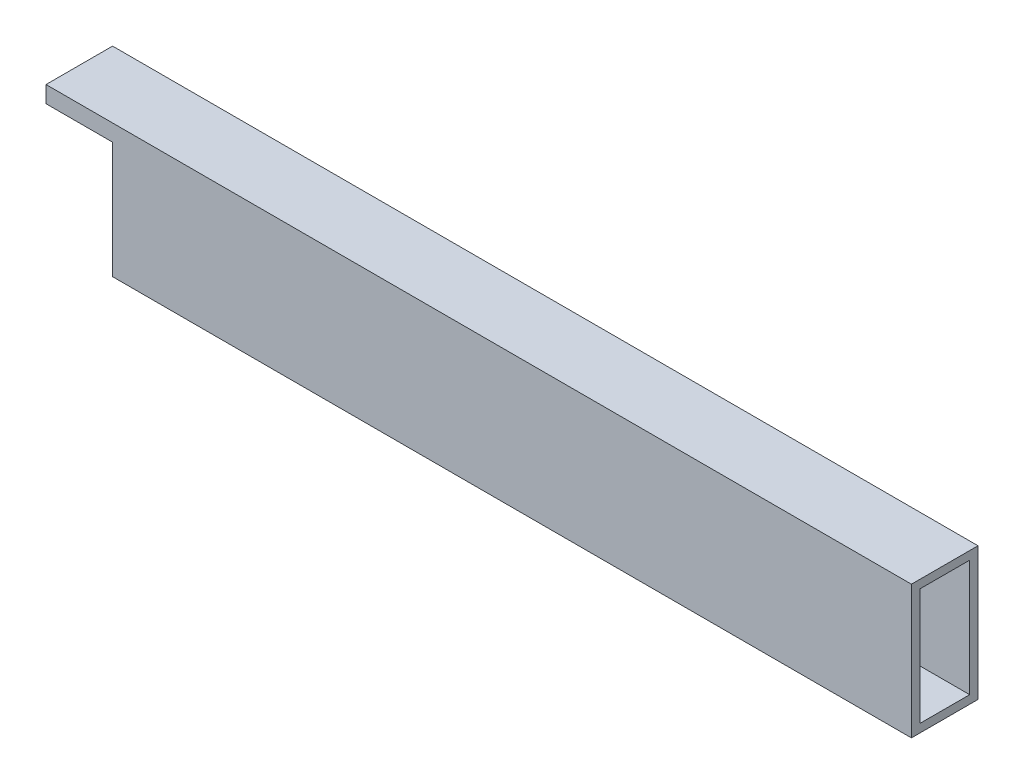
ISO-10303-21;
HEADER;
FILE_DESCRIPTION(('STEP AP214'),'2;1');
FILE_NAME('part.step','',(''),(''),'','','');
FILE_SCHEMA(('AUTOMOTIVE_DESIGN { 1 0 10303 214 1 1 1 1 }'));
ENDSEC;
DATA;
#1=APPLICATION_CONTEXT('core data for automotive mechanical design processes');
#2=APPLICATION_PROTOCOL_DEFINITION('international standard','automotive_design',2000,#1);
#3=PRODUCT_CONTEXT('',#1,'mechanical');
#4=PRODUCT('Part','Part','',(#3));
#5=PRODUCT_RELATED_PRODUCT_CATEGORY('part','',(#4));
#6=PRODUCT_DEFINITION_FORMATION('','',#4);
#7=PRODUCT_DEFINITION_CONTEXT('part definition',#1,'design');
#8=PRODUCT_DEFINITION('design','',#6,#7);
#9=PRODUCT_DEFINITION_SHAPE('','',#8);
#10=(LENGTH_UNIT() NAMED_UNIT(*) SI_UNIT(.MILLI.,.METRE.));
#11=(NAMED_UNIT(*) PLANE_ANGLE_UNIT() SI_UNIT($,.RADIAN.));
#12=(NAMED_UNIT(*) SI_UNIT($,.STERADIAN.) SOLID_ANGLE_UNIT());
#13=UNCERTAINTY_MEASURE_WITH_UNIT(LENGTH_MEASURE(1.E-05),#10,'distance_accuracy_value','');
#14=(GEOMETRIC_REPRESENTATION_CONTEXT(3) GLOBAL_UNCERTAINTY_ASSIGNED_CONTEXT((#13)) GLOBAL_UNIT_ASSIGNED_CONTEXT((#10,
#11,#12)) REPRESENTATION_CONTEXT('',''));
#15=CARTESIAN_POINT('',(0.,0.,0.));
#16=DIRECTION('',(0.,0.,1.));
#17=DIRECTION('',(1.,0.,0.));
#18=AXIS2_PLACEMENT_3D('',#15,#16,#17);
#19=CARTESIAN_POINT('',(-330.2,50.8,25.4));
#20=DIRECTION('',(1.,0.,0.));
#21=DIRECTION('',(0.,0.,-1.));
#22=AXIS2_PLACEMENT_3D('',#19,#20,#21);
#23=PLANE('',#22);
#24=DIRECTION('',(0.,-1.,0.));
#25=VECTOR('',#24,1.);
#26=CARTESIAN_POINT('',(-330.2,50.8,0.));
#27=LINE('',#26,#25);
#28=CARTESIAN_POINT('',(-330.2,50.8,0.));
#29=VERTEX_POINT('',#28);
#30=CARTESIAN_POINT('',(-330.2,44.45,0.));
#31=VERTEX_POINT('',#30);
#32=EDGE_CURVE('E201',#29,#31,#27,.T.);
#33=ORIENTED_EDGE('',*,*,#32,.T.);
#34=DIRECTION('',(0.,0.,-1.));
#35=VECTOR('',#34,1.);
#36=CARTESIAN_POINT('',(-330.2,44.45,31.496));
#37=LINE('',#36,#35);
#38=CARTESIAN_POINT('',(-330.2,44.45,3.175));
#39=VERTEX_POINT('',#38);
#40=EDGE_CURVE('E137',#39,#31,#37,.T.);
#41=ORIENTED_EDGE('',*,*,#40,.F.);
#42=DIRECTION('',(0.,-1.,0.));
#43=VECTOR('',#42,1.);
#44=CARTESIAN_POINT('',(-330.2,47.625,3.175));
#45=LINE('',#44,#43);
#46=CARTESIAN_POINT('',(-330.2,47.625,3.175));
#47=VERTEX_POINT('',#46);
#48=EDGE_CURVE('E163',#47,#39,#45,.T.);
#49=ORIENTED_EDGE('',*,*,#48,.F.);
#50=DIRECTION('',(0.,0.,-1.));
#51=VECTOR('',#50,1.);
#52=CARTESIAN_POINT('',(-330.2,47.625,3.175));
#53=LINE('',#52,#51);
#54=CARTESIAN_POINT('',(-330.2,47.625,22.225));
#55=VERTEX_POINT('',#54);
#56=EDGE_CURVE('E168',#55,#47,#53,.T.);
#57=ORIENTED_EDGE('',*,*,#56,.F.);
#58=DIRECTION('',(0.,1.,0.));
#59=VECTOR('',#58,1.);
#60=CARTESIAN_POINT('',(-330.2,47.625,22.225));
#61=LINE('',#60,#59);
#62=CARTESIAN_POINT('',(-330.2,44.45,22.225));
#63=VERTEX_POINT('',#62);
#64=EDGE_CURVE('E178',#63,#55,#61,.T.);
#65=ORIENTED_EDGE('',*,*,#64,.F.);
#66=CARTESIAN_POINT('',(-330.2,44.45,25.4));
#67=VERTEX_POINT('',#66);
#68=EDGE_CURVE('E150',#67,#63,#37,.T.);
#69=ORIENTED_EDGE('',*,*,#68,.F.);
#70=DIRECTION('',(0.,-1.,0.));
#71=VECTOR('',#70,1.);
#72=CARTESIAN_POINT('',(-330.2,50.8,25.4));
#73=LINE('',#72,#71);
#74=CARTESIAN_POINT('',(-330.2,50.8,25.4));
#75=VERTEX_POINT('',#74);
#76=EDGE_CURVE('E212',#75,#67,#73,.T.);
#77=ORIENTED_EDGE('',*,*,#76,.F.);
#78=DIRECTION('',(0.,0.,1.));
#79=VECTOR('',#78,1.);
#80=CARTESIAN_POINT('',(-330.2,50.8,25.4));
#81=LINE('',#80,#79);
#82=EDGE_CURVE('E192',#29,#75,#81,.T.);
#83=ORIENTED_EDGE('',*,*,#82,.F.);
#84=EDGE_LOOP('',(#33,#41,#49,#57,#65,#69,#77,#83));
#85=FACE_BOUND('',#84,.T.);
#86=ADVANCED_FACE('F33',(#85),#23,.F.);
#87=CARTESIAN_POINT('',(0.,50.8,25.4));
#88=DIRECTION('',(0.,0.,-1.));
#89=DIRECTION('',(-1.,0.,0.));
#90=AXIS2_PLACEMENT_3D('',#87,#88,#89);
#91=PLANE('',#90);
#92=ORIENTED_EDGE('',*,*,#76,.T.);
#93=DIRECTION('',(1.,0.,0.));
#94=VECTOR('',#93,1.);
#95=CARTESIAN_POINT('',(0.,44.45,25.4));
#96=LINE('',#95,#94);
#97=CARTESIAN_POINT('',(-304.8,44.45,25.4));
#98=VERTEX_POINT('',#97);
#99=EDGE_CURVE('E160',#67,#98,#96,.T.);
#100=ORIENTED_EDGE('',*,*,#99,.T.);
#101=DIRECTION('',(0.,-1.,0.));
#102=VECTOR('',#101,1.);
#103=CARTESIAN_POINT('',(-304.8,50.8,25.4));
#104=LINE('',#103,#102);
#105=CARTESIAN_POINT('',(-304.8,0.,25.4));
#106=VERTEX_POINT('',#105);
#107=EDGE_CURVE('E155',#98,#106,#104,.T.);
#108=ORIENTED_EDGE('',*,*,#107,.T.);
#109=DIRECTION('',(1.,0.,0.));
#110=VECTOR('',#109,1.);
#111=CARTESIAN_POINT('',(0.,0.,25.4));
#112=LINE('',#111,#110);
#113=CARTESIAN_POINT('',(0.,0.,25.4));
#114=VERTEX_POINT('',#113);
#115=EDGE_CURVE('E184',#106,#114,#112,.T.);
#116=ORIENTED_EDGE('',*,*,#115,.T.);
#117=DIRECTION('',(0.,-1.,0.));
#118=VECTOR('',#117,1.);
#119=CARTESIAN_POINT('',(0.,50.8,25.4));
#120=LINE('',#119,#118);
#121=CARTESIAN_POINT('',(0.,50.8,25.4));
#122=VERTEX_POINT('',#121);
#123=EDGE_CURVE('E209',#122,#114,#120,.T.);
#124=ORIENTED_EDGE('',*,*,#123,.F.);
#125=DIRECTION('',(1.,0.,0.));
#126=VECTOR('',#125,1.);
#127=CARTESIAN_POINT('',(0.,50.8,25.4));
#128=LINE('',#127,#126);
#129=EDGE_CURVE('E195',#75,#122,#128,.T.);
#130=ORIENTED_EDGE('',*,*,#129,.F.);
#131=EDGE_LOOP('',(#92,#100,#108,#116,#124,#130));
#132=FACE_BOUND('',#131,.T.);
#133=ADVANCED_FACE('F247',(#132),#91,.F.);
#134=CARTESIAN_POINT('',(0.,50.8,0.));
#135=DIRECTION('',(-1.,0.,0.));
#136=DIRECTION('',(0.,0.,1.));
#137=AXIS2_PLACEMENT_3D('',#134,#135,#136);
#138=PLANE('',#137);
#139=DIRECTION('',(0.,0.,-1.));
#140=VECTOR('',#139,1.);
#141=CARTESIAN_POINT('',(0.,47.625,3.175));
#142=LINE('',#141,#140);
#143=CARTESIAN_POINT('',(0.,47.625,22.225));
#144=VERTEX_POINT('',#143);
#145=CARTESIAN_POINT('',(0.,47.625,3.175));
#146=VERTEX_POINT('',#145);
#147=EDGE_CURVE('E172',#144,#146,#142,.T.);
#148=ORIENTED_EDGE('',*,*,#147,.T.);
#149=DIRECTION('',(0.,-1.,0.));
#150=VECTOR('',#149,1.);
#151=CARTESIAN_POINT('',(0.,47.625,3.175));
#152=LINE('',#151,#150);
#153=CARTESIAN_POINT('',(0.,3.175,3.17500000000001));
#154=VERTEX_POINT('',#153);
#155=EDGE_CURVE('E164',#146,#154,#152,.T.);
#156=ORIENTED_EDGE('',*,*,#155,.T.);
#157=DIRECTION('',(0.,0.,1.));
#158=VECTOR('',#157,1.);
#159=CARTESIAN_POINT('',(0.,3.175,3.17500000000001));
#160=LINE('',#159,#158);
#161=CARTESIAN_POINT('',(0.,3.175,22.225));
#162=VERTEX_POINT('',#161);
#163=EDGE_CURVE('E167',#154,#162,#160,.T.);
#164=ORIENTED_EDGE('',*,*,#163,.T.);
#165=DIRECTION('',(0.,1.,0.));
#166=VECTOR('',#165,1.);
#167=CARTESIAN_POINT('',(0.,47.625,22.225));
#168=LINE('',#167,#166);
#169=EDGE_CURVE('E55',#162,#144,#168,.T.);
#170=ORIENTED_EDGE('',*,*,#169,.T.);
#171=EDGE_LOOP('',(#148,#156,#164,#170));
#172=FACE_BOUND('',#171,.T.);
#173=DIRECTION('',(0.,0.,-1.));
#174=VECTOR('',#173,1.);
#175=CARTESIAN_POINT('',(0.,0.,0.));
#176=LINE('',#175,#174);
#177=CARTESIAN_POINT('',(0.,0.,0.));
#178=VERTEX_POINT('',#177);
#179=EDGE_CURVE('E203',#114,#178,#176,.T.);
#180=ORIENTED_EDGE('',*,*,#179,.T.);
#181=DIRECTION('',(0.,-1.,0.));
#182=VECTOR('',#181,1.);
#183=CARTESIAN_POINT('',(0.,50.8,0.));
#184=LINE('',#183,#182);
#185=CARTESIAN_POINT('',(0.,50.8,0.));
#186=VERTEX_POINT('',#185);
#187=EDGE_CURVE('E207',#186,#178,#184,.T.);
#188=ORIENTED_EDGE('',*,*,#187,.F.);
#189=DIRECTION('',(0.,0.,-1.));
#190=VECTOR('',#189,1.);
#191=CARTESIAN_POINT('',(0.,50.8,0.));
#192=LINE('',#191,#190);
#193=EDGE_CURVE('E197',#122,#186,#192,.T.);
#194=ORIENTED_EDGE('',*,*,#193,.F.);
#195=ORIENTED_EDGE('',*,*,#123,.T.);
#196=EDGE_LOOP('',(#180,#188,#194,#195));
#197=FACE_BOUND('',#196,.T.);
#198=ADVANCED_FACE('F231',(#172,#197),#138,.F.);
#199=CARTESIAN_POINT('',(-330.2,50.8,0.));
#200=DIRECTION('',(0.,0.,1.));
#201=DIRECTION('',(1.,0.,0.));
#202=AXIS2_PLACEMENT_3D('',#199,#200,#201);
#203=PLANE('',#202);
#204=DIRECTION('',(0.,-1.,0.));
#205=VECTOR('',#204,1.);
#206=CARTESIAN_POINT('',(-304.8,0.,0.));
#207=LINE('',#206,#205);
#208=CARTESIAN_POINT('',(-304.8,44.45,0.));
#209=VERTEX_POINT('',#208);
#210=CARTESIAN_POINT('',(-304.8,0.,0.));
#211=VERTEX_POINT('',#210);
#212=EDGE_CURVE('E125',#209,#211,#207,.T.);
#213=ORIENTED_EDGE('',*,*,#212,.F.);
#214=DIRECTION('',(1.,0.,0.));
#215=VECTOR('',#214,1.);
#216=CARTESIAN_POINT('',(0.,44.45,0.));
#217=LINE('',#216,#215);
#218=EDGE_CURVE('E134',#31,#209,#217,.T.);
#219=ORIENTED_EDGE('',*,*,#218,.F.);
#220=ORIENTED_EDGE('',*,*,#32,.F.);
#221=DIRECTION('',(-1.,0.,0.));
#222=VECTOR('',#221,1.);
#223=CARTESIAN_POINT('',(-330.2,50.8,0.));
#224=LINE('',#223,#222);
#225=EDGE_CURVE('E199',#186,#29,#224,.T.);
#226=ORIENTED_EDGE('',*,*,#225,.F.);
#227=ORIENTED_EDGE('',*,*,#187,.T.);
#228=DIRECTION('',(-1.,0.,0.));
#229=VECTOR('',#228,1.);
#230=CARTESIAN_POINT('',(-330.2,0.,0.));
#231=LINE('',#230,#229);
#232=EDGE_CURVE('E146',#178,#211,#231,.T.);
#233=ORIENTED_EDGE('',*,*,#232,.T.);
#234=EDGE_LOOP('',(#213,#219,#220,#226,#227,#233));
#235=FACE_BOUND('',#234,.T.);
#236=ADVANCED_FACE('F143',(#235),#203,.F.);
#237=CARTESIAN_POINT('',(0.,50.8,0.));
#238=DIRECTION('',(0.,-1.,0.));
#239=DIRECTION('',(0.,0.,-1.));
#240=AXIS2_PLACEMENT_3D('',#237,#238,#239);
#241=PLANE('',#240);
#242=ORIENTED_EDGE('',*,*,#82,.T.);
#243=ORIENTED_EDGE('',*,*,#129,.T.);
#244=ORIENTED_EDGE('',*,*,#193,.T.);
#245=ORIENTED_EDGE('',*,*,#225,.T.);
#246=EDGE_LOOP('',(#242,#243,#244,#245));
#247=FACE_BOUND('',#246,.T.);
#248=ADVANCED_FACE('F239',(#247),#241,.F.);
#249=CARTESIAN_POINT('',(0.,0.,0.));
#250=DIRECTION('',(0.,-1.,0.));
#251=DIRECTION('',(0.,0.,-1.));
#252=AXIS2_PLACEMENT_3D('',#249,#250,#251);
#253=PLANE('',#252);
#254=DIRECTION('',(0.,0.,-1.));
#255=VECTOR('',#254,1.);
#256=CARTESIAN_POINT('',(-304.8,0.,31.496));
#257=LINE('',#256,#255);
#258=EDGE_CURVE('E151',#106,#211,#257,.T.);
#259=ORIENTED_EDGE('',*,*,#258,.T.);
#260=ORIENTED_EDGE('',*,*,#232,.F.);
#261=ORIENTED_EDGE('',*,*,#179,.F.);
#262=ORIENTED_EDGE('',*,*,#115,.F.);
#263=EDGE_LOOP('',(#259,#260,#261,#262));
#264=FACE_BOUND('',#263,.T.);
#265=ADVANCED_FACE('F245',(#264),#253,.T.);
#266=CARTESIAN_POINT('',(0.,47.625,3.175));
#267=DIRECTION('',(0.,0.,-1.));
#268=DIRECTION('',(0.,1.,0.));
#269=AXIS2_PLACEMENT_3D('',#266,#267,#268);
#270=PLANE('',#269);
#271=ORIENTED_EDGE('',*,*,#48,.T.);
#272=DIRECTION('',(1.,0.,0.));
#273=VECTOR('',#272,1.);
#274=CARTESIAN_POINT('',(0.,44.45,3.175));
#275=LINE('',#274,#273);
#276=CARTESIAN_POINT('',(-304.8,44.45,3.175));
#277=VERTEX_POINT('',#276);
#278=EDGE_CURVE('E158',#39,#277,#275,.T.);
#279=ORIENTED_EDGE('',*,*,#278,.T.);
#280=DIRECTION('',(0.,-1.,0.));
#281=VECTOR('',#280,1.);
#282=CARTESIAN_POINT('',(-304.8,47.625,3.175));
#283=LINE('',#282,#281);
#284=CARTESIAN_POINT('',(-304.8,3.175,3.17500000000001));
#285=VERTEX_POINT('',#284);
#286=EDGE_CURVE('E128',#277,#285,#283,.T.);
#287=ORIENTED_EDGE('',*,*,#286,.T.);
#288=DIRECTION('',(-1.,0.,0.));
#289=VECTOR('',#288,1.);
#290=CARTESIAN_POINT('',(0.,3.175,3.17500000000001));
#291=LINE('',#290,#289);
#292=EDGE_CURVE('E175',#154,#285,#291,.T.);
#293=ORIENTED_EDGE('',*,*,#292,.F.);
#294=ORIENTED_EDGE('',*,*,#155,.F.);
#295=DIRECTION('',(-1.,0.,0.));
#296=VECTOR('',#295,1.);
#297=CARTESIAN_POINT('',(0.,47.625,3.175));
#298=LINE('',#297,#296);
#299=EDGE_CURVE('E182',#146,#47,#298,.T.);
#300=ORIENTED_EDGE('',*,*,#299,.T.);
#301=EDGE_LOOP('',(#271,#279,#287,#293,#294,#300));
#302=FACE_BOUND('',#301,.T.);
#303=ADVANCED_FACE('F234',(#302),#270,.F.);
#304=CARTESIAN_POINT('',(0.,47.625,3.175));
#305=DIRECTION('',(0.,1.,0.));
#306=DIRECTION('',(0.,0.,1.));
#307=AXIS2_PLACEMENT_3D('',#304,#305,#306);
#308=PLANE('',#307);
#309=ORIENTED_EDGE('',*,*,#56,.T.);
#310=ORIENTED_EDGE('',*,*,#299,.F.);
#311=ORIENTED_EDGE('',*,*,#147,.F.);
#312=DIRECTION('',(-1.,0.,0.));
#313=VECTOR('',#312,1.);
#314=CARTESIAN_POINT('',(0.,47.625,22.225));
#315=LINE('',#314,#313);
#316=EDGE_CURVE('E185',#144,#55,#315,.T.);
#317=ORIENTED_EDGE('',*,*,#316,.T.);
#318=EDGE_LOOP('',(#309,#310,#311,#317));
#319=FACE_BOUND('',#318,.T.);
#320=ADVANCED_FACE('F227',(#319),#308,.F.);
#321=CARTESIAN_POINT('',(0.,47.625,22.225));
#322=DIRECTION('',(0.,0.,1.));
#323=DIRECTION('',(0.,-1.,0.));
#324=AXIS2_PLACEMENT_3D('',#321,#322,#323);
#325=PLANE('',#324);
#326=DIRECTION('',(0.,1.,0.));
#327=VECTOR('',#326,1.);
#328=CARTESIAN_POINT('',(-304.8,47.625,22.225));
#329=LINE('',#328,#327);
#330=CARTESIAN_POINT('',(-304.8,3.175,22.225));
#331=VERTEX_POINT('',#330);
#332=CARTESIAN_POINT('',(-304.8,44.45,22.225));
#333=VERTEX_POINT('',#332);
#334=EDGE_CURVE('E47',#331,#333,#329,.T.);
#335=ORIENTED_EDGE('',*,*,#334,.T.);
#336=DIRECTION('',(-1.,0.,0.));
#337=VECTOR('',#336,1.);
#338=CARTESIAN_POINT('',(0.,44.45,22.225));
#339=LINE('',#338,#337);
#340=EDGE_CURVE('E11',#333,#63,#339,.T.);
#341=ORIENTED_EDGE('',*,*,#340,.T.);
#342=ORIENTED_EDGE('',*,*,#64,.T.);
#343=ORIENTED_EDGE('',*,*,#316,.F.);
#344=ORIENTED_EDGE('',*,*,#169,.F.);
#345=DIRECTION('',(-1.,0.,0.));
#346=VECTOR('',#345,1.);
#347=CARTESIAN_POINT('',(0.,3.175,22.225));
#348=LINE('',#347,#346);
#349=EDGE_CURVE('E188',#162,#331,#348,.T.);
#350=ORIENTED_EDGE('',*,*,#349,.T.);
#351=EDGE_LOOP('',(#335,#341,#342,#343,#344,#350));
#352=FACE_BOUND('',#351,.T.);
#353=ADVANCED_FACE('F217',(#352),#325,.F.);
#354=CARTESIAN_POINT('',(0.,3.175,3.17500000000001));
#355=DIRECTION('',(0.,-1.,0.));
#356=DIRECTION('',(0.,0.,-1.));
#357=AXIS2_PLACEMENT_3D('',#354,#355,#356);
#358=PLANE('',#357);
#359=ORIENTED_EDGE('',*,*,#292,.T.);
#360=DIRECTION('',(0.,0.,1.));
#361=VECTOR('',#360,1.);
#362=CARTESIAN_POINT('',(-304.8,3.175,3.17500000000001));
#363=LINE('',#362,#361);
#364=EDGE_CURVE('E40',#285,#331,#363,.T.);
#365=ORIENTED_EDGE('',*,*,#364,.T.);
#366=ORIENTED_EDGE('',*,*,#349,.F.);
#367=ORIENTED_EDGE('',*,*,#163,.F.);
#368=EDGE_LOOP('',(#359,#365,#366,#367));
#369=FACE_BOUND('',#368,.T.);
#370=ADVANCED_FACE('F215',(#369),#358,.F.);
#371=CARTESIAN_POINT('',(0.,44.45,31.496));
#372=DIRECTION('',(0.,1.,0.));
#373=DIRECTION('',(0.,0.,1.));
#374=AXIS2_PLACEMENT_3D('',#371,#372,#373);
#375=PLANE('',#374);
#376=ORIENTED_EDGE('',*,*,#68,.T.);
#377=ORIENTED_EDGE('',*,*,#340,.F.);
#378=DIRECTION('',(0.,0.,-1.));
#379=VECTOR('',#378,1.);
#380=CARTESIAN_POINT('',(-304.8,44.45,31.496));
#381=LINE('',#380,#379);
#382=EDGE_CURVE('E131',#98,#333,#381,.T.);
#383=ORIENTED_EDGE('',*,*,#382,.F.);
#384=ORIENTED_EDGE('',*,*,#99,.F.);
#385=EDGE_LOOP('',(#376,#377,#383,#384));
#386=FACE_BOUND('',#385,.T.);
#387=ADVANCED_FACE('F248',(#386),#375,.F.);
#388=ORIENTED_EDGE('',*,*,#40,.T.);
#389=ORIENTED_EDGE('',*,*,#218,.T.);
#390=EDGE_CURVE('E121',#277,#209,#381,.T.);
#391=ORIENTED_EDGE('',*,*,#390,.F.);
#392=ORIENTED_EDGE('',*,*,#278,.F.);
#393=EDGE_LOOP('',(#388,#389,#391,#392));
#394=FACE_BOUND('',#393,.T.);
#395=ADVANCED_FACE('F135',(#394),#375,.F.);
#396=CARTESIAN_POINT('',(-304.8,0.,31.496));
#397=DIRECTION('',(1.,0.,0.));
#398=DIRECTION('',(0.,0.,-1.));
#399=AXIS2_PLACEMENT_3D('',#396,#397,#398);
#400=PLANE('',#399);
#401=ORIENTED_EDGE('',*,*,#382,.T.);
#402=ORIENTED_EDGE('',*,*,#334,.F.);
#403=ORIENTED_EDGE('',*,*,#364,.F.);
#404=ORIENTED_EDGE('',*,*,#286,.F.);
#405=ORIENTED_EDGE('',*,*,#390,.T.);
#406=ORIENTED_EDGE('',*,*,#212,.T.);
#407=ORIENTED_EDGE('',*,*,#258,.F.);
#408=ORIENTED_EDGE('',*,*,#107,.F.);
#409=EDGE_LOOP('',(#401,#402,#403,#404,#405,#406,#407,#408));
#410=FACE_BOUND('',#409,.T.);
#411=ADVANCED_FACE('F123',(#410),#400,.F.);
#412=CLOSED_SHELL('',(#86,#133,#198,#236,#248,#265,#303,#320,#353,#370,#387,#395,#411));
#413=MANIFOLD_SOLID_BREP('B2',#412);
#414=ADVANCED_BREP_SHAPE_REPRESENTATION('',(#18,#413),#14);
#415=SHAPE_DEFINITION_REPRESENTATION(#9,#414);
ENDSEC;
END-ISO-10303-21;
